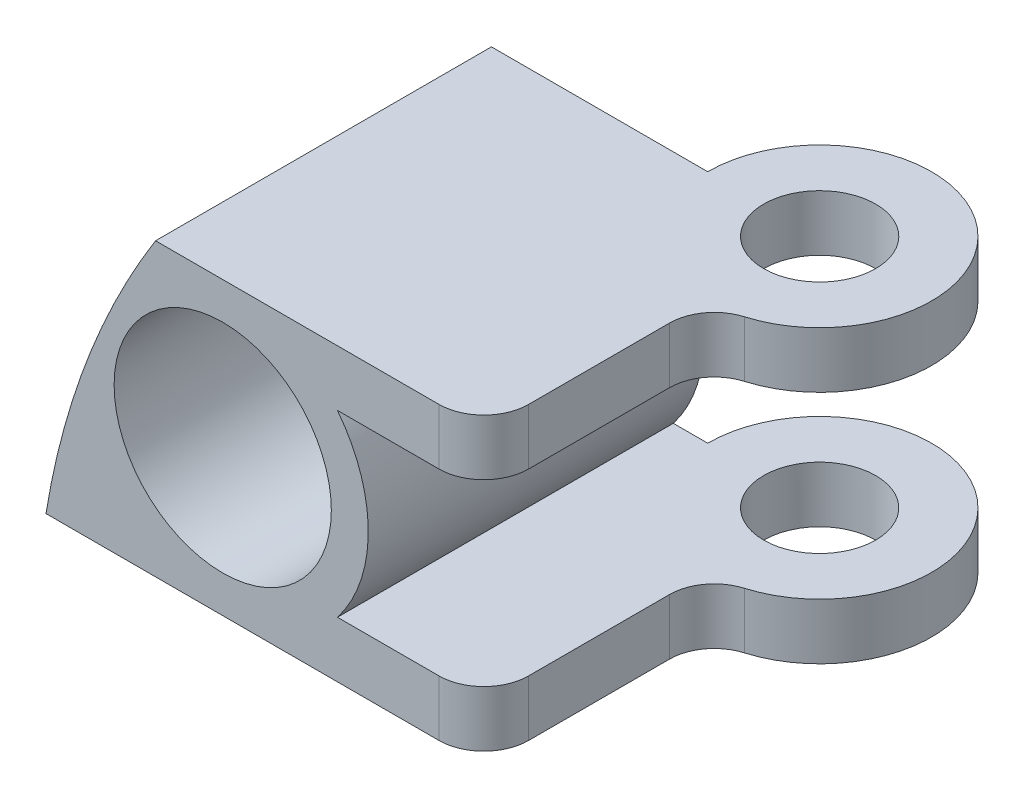
ISO-10303-21;
HEADER;
FILE_DESCRIPTION(('STEP AP214'),'2;1');
FILE_NAME('part.step','',(''),(''),'','','');
FILE_SCHEMA(('AUTOMOTIVE_DESIGN { 1 0 10303 214 1 1 1 1 }'));
ENDSEC;
DATA;
#1=APPLICATION_CONTEXT('core data for automotive mechanical design processes');
#2=APPLICATION_PROTOCOL_DEFINITION('international standard','automotive_design',2000,#1);
#3=PRODUCT_CONTEXT('',#1,'mechanical');
#4=PRODUCT('Part','Part','',(#3));
#5=PRODUCT_RELATED_PRODUCT_CATEGORY('part','',(#4));
#6=PRODUCT_DEFINITION_FORMATION('','',#4);
#7=PRODUCT_DEFINITION_CONTEXT('part definition',#1,'design');
#8=PRODUCT_DEFINITION('design','',#6,#7);
#9=PRODUCT_DEFINITION_SHAPE('','',#8);
#10=(LENGTH_UNIT() NAMED_UNIT(*) SI_UNIT(.MILLI.,.METRE.));
#11=(NAMED_UNIT(*) PLANE_ANGLE_UNIT() SI_UNIT($,.RADIAN.));
#12=(NAMED_UNIT(*) SI_UNIT($,.STERADIAN.) SOLID_ANGLE_UNIT());
#13=UNCERTAINTY_MEASURE_WITH_UNIT(LENGTH_MEASURE(1.E-05),#10,'distance_accuracy_value','');
#14=(GEOMETRIC_REPRESENTATION_CONTEXT(3) GLOBAL_UNCERTAINTY_ASSIGNED_CONTEXT((#13)) GLOBAL_UNIT_ASSIGNED_CONTEXT((#10,
#11,#12)) REPRESENTATION_CONTEXT('',''));
#15=CARTESIAN_POINT('',(0.,0.,0.));
#16=DIRECTION('',(0.,0.,1.));
#17=DIRECTION('',(1.,0.,0.));
#18=AXIS2_PLACEMENT_3D('',#15,#16,#17);
#19=CARTESIAN_POINT('',(-33.8574358250765,15.3458200795581,25.4));
#20=DIRECTION('',(0.,0.,1.));
#21=DIRECTION('',(1.,0.,0.));
#22=AXIS2_PLACEMENT_3D('',#19,#20,#21);
#23=PLANE('',#22);
#24=DIRECTION('',(1.,0.,0.));
#25=VECTOR('',#24,1.);
#26=CARTESIAN_POINT('',(-43.8807790564313,7.09082007955806,25.4));
#27=LINE('',#26,#25);
#28=CARTESIAN_POINT('',(-43.8807790564313,7.09082007955806,25.4));
#29=VERTEX_POINT('',#28);
#30=CARTESIAN_POINT('',(-21.59,7.09082007955806,25.4));
#31=VERTEX_POINT('',#30);
#32=EDGE_CURVE('E276',#29,#31,#27,.T.);
#33=ORIENTED_EDGE('',*,*,#32,.T.);
#34=DIRECTION('',(0.,1.,0.));
#35=VECTOR('',#34,1.);
#36=CARTESIAN_POINT('',(-21.59,10.2658200795581,25.4));
#37=LINE('',#36,#35);
#38=CARTESIAN_POINT('',(-21.59,10.2658200795581,25.4));
#39=VERTEX_POINT('',#38);
#40=EDGE_CURVE('E312',#31,#39,#37,.T.);
#41=ORIENTED_EDGE('',*,*,#40,.T.);
#42=DIRECTION('',(-1.,0.,0.));
#43=VECTOR('',#42,1.);
#44=CARTESIAN_POINT('',(-27.3506220886921,10.2658200795581,25.4));
#45=LINE('',#44,#43);
#46=CARTESIAN_POINT('',(-27.3506220886921,10.2658200795581,25.4));
#47=VERTEX_POINT('',#46);
#48=EDGE_CURVE('E273',#39,#47,#45,.T.);
#49=ORIENTED_EDGE('',*,*,#48,.T.);
#50=CARTESIAN_POINT('',(-33.8574358250765,15.3458200795581,25.4));
#51=DIRECTION('',(0.,0.,1.));
#52=DIRECTION('',(1.,0.,0.));
#53=AXIS2_PLACEMENT_3D('',#50,#51,#52);
#54=CIRCLE('',#53,8.255);
#55=CARTESIAN_POINT('',(-27.3506220886921,20.4258200795581,25.4));
#56=VERTEX_POINT('',#55);
#57=EDGE_CURVE('E270',#47,#56,#54,.T.);
#58=ORIENTED_EDGE('',*,*,#57,.T.);
#59=DIRECTION('',(1.,0.,0.));
#60=VECTOR('',#59,1.);
#61=CARTESIAN_POINT('',(-27.3506220886921,20.4258200795581,25.4));
#62=LINE('',#61,#60);
#63=CARTESIAN_POINT('',(-21.59,20.4258200795581,25.4));
#64=VERTEX_POINT('',#63);
#65=EDGE_CURVE('E328',#56,#64,#62,.T.);
#66=ORIENTED_EDGE('',*,*,#65,.T.);
#67=DIRECTION('',(0.,1.,0.));
#68=VECTOR('',#67,1.);
#69=CARTESIAN_POINT('',(-21.59,23.6008200795581,25.4));
#70=LINE('',#69,#68);
#71=CARTESIAN_POINT('',(-21.59,23.6008200795581,25.4));
#72=VERTEX_POINT('',#71);
#73=EDGE_CURVE('E309',#64,#72,#70,.T.);
#74=ORIENTED_EDGE('',*,*,#73,.T.);
#75=DIRECTION('',(-1.,0.,0.));
#76=VECTOR('',#75,1.);
#77=CARTESIAN_POINT('',(-37.6670119809407,23.6008200795581,25.4));
#78=LINE('',#77,#76);
#79=CARTESIAN_POINT('',(-37.6670119809407,23.6008200795581,25.4));
#80=VERTEX_POINT('',#79);
#81=EDGE_CURVE('E325',#72,#80,#78,.T.);
#82=ORIENTED_EDGE('',*,*,#81,.T.);
#83=CARTESIAN_POINT('',(0.,0.,25.4));
#84=DIRECTION('',(0.,0.,1.));
#85=DIRECTION('',(-1.,0.,0.));
#86=AXIS2_PLACEMENT_3D('',#83,#84,#85);
#87=CIRCLE('',#86,44.45);
#88=EDGE_CURVE('E332',#80,#29,#87,.T.);
#89=ORIENTED_EDGE('',*,*,#88,.T.);
#90=EDGE_LOOP('',(#33,#41,#49,#58,#66,#74,#82,#89));
#91=FACE_BOUND('',#90,.T.);
#92=CARTESIAN_POINT('',(-33.8574358250765,15.3458200795581,25.4));
#93=DIRECTION('',(0.,0.,1.));
#94=DIRECTION('',(1.,0.,0.));
#95=AXIS2_PLACEMENT_3D('',#92,#93,#94);
#96=CIRCLE('',#95,6.1595);
#97=CARTESIAN_POINT('',(-27.6979358250765,15.3458200795581,25.4));
#98=VERTEX_POINT('',#97);
#99=EDGE_CURVE('E334',#98,#98,#96,.T.);
#100=ORIENTED_EDGE('',*,*,#99,.F.);
#101=EDGE_LOOP('',(#100));
#102=FACE_BOUND('',#101,.T.);
#103=ADVANCED_FACE('F35',(#91,#102),#23,.T.);
#104=CARTESIAN_POINT('',(-33.8574358250765,15.3458200795581,25.4));
#105=DIRECTION('',(0.,0.,-1.));
#106=DIRECTION('',(-1.,0.,0.));
#107=AXIS2_PLACEMENT_3D('',#104,#105,#106);
#108=CYLINDRICAL_SURFACE('',#107,8.255);
#109=DIRECTION('',(0.,0.,-1.));
#110=VECTOR('',#109,1.);
#111=CARTESIAN_POINT('',(-27.3506220886921,10.2658200795581,25.4));
#112=LINE('',#111,#110);
#113=CARTESIAN_POINT('',(-27.3506220886921,10.2658200795581,6.35));
#114=VERTEX_POINT('',#113);
#115=EDGE_CURVE('E268',#47,#114,#112,.T.);
#116=ORIENTED_EDGE('',*,*,#115,.T.);
#117=CARTESIAN_POINT('',(-33.8574358250765,15.3458200795581,6.35));
#118=DIRECTION('',(0.,0.,1.));
#119=DIRECTION('',(1.,0.,0.));
#120=AXIS2_PLACEMENT_3D('',#117,#118,#119);
#121=CIRCLE('',#120,8.255);
#122=CARTESIAN_POINT('',(-27.3506220886921,20.4258200795581,6.35));
#123=VERTEX_POINT('',#122);
#124=EDGE_CURVE('E181',#114,#123,#121,.T.);
#125=ORIENTED_EDGE('',*,*,#124,.T.);
#126=DIRECTION('',(0.,0.,-1.));
#127=VECTOR('',#126,1.);
#128=CARTESIAN_POINT('',(-27.3506220886921,20.4258200795581,25.4));
#129=LINE('',#128,#127);
#130=EDGE_CURVE('E262',#56,#123,#129,.T.);
#131=ORIENTED_EDGE('',*,*,#130,.F.);
#132=ORIENTED_EDGE('',*,*,#57,.F.);
#133=EDGE_LOOP('',(#116,#125,#131,#132));
#134=FACE_BOUND('',#133,.T.);
#135=ADVANCED_FACE('F227',(#134),#108,.T.);
#136=CARTESIAN_POINT('',(-27.3506220886921,20.4258200795581,25.4));
#137=DIRECTION('',(0.,1.,0.));
#138=DIRECTION('',(0.,0.,1.));
#139=AXIS2_PLACEMENT_3D('',#136,#137,#138);
#140=PLANE('',#139);
#141=DIRECTION('',(0.,0.,1.));
#142=VECTOR('',#141,1.);
#143=CARTESIAN_POINT('',(-19.05,20.4258200795581,25.4));
#144=LINE('',#143,#142);
#145=CARTESIAN_POINT('',(-19.05,20.4258200795581,14.8694189942742));
#146=VERTEX_POINT('',#145);
#147=CARTESIAN_POINT('',(-19.05,20.4258200795581,22.86));
#148=VERTEX_POINT('',#147);
#149=EDGE_CURVE('E192',#146,#148,#144,.T.);
#150=ORIENTED_EDGE('',*,*,#149,.T.);
#151=CARTESIAN_POINT('',(-21.59,20.4258200795581,22.86));
#152=DIRECTION('',(0.,1.,0.));
#153=DIRECTION('',(0.,0.,1.));
#154=AXIS2_PLACEMENT_3D('',#151,#152,#153);
#155=CIRCLE('',#154,2.54);
#156=EDGE_CURVE('E11',#148,#64,#155,.F.);
#157=ORIENTED_EDGE('',*,*,#156,.T.);
#158=ORIENTED_EDGE('',*,*,#65,.F.);
#159=ORIENTED_EDGE('',*,*,#130,.T.);
#160=DIRECTION('',(1.,0.,0.));
#161=VECTOR('',#160,1.);
#162=CARTESIAN_POINT('',(-27.3506220886921,20.4258200795581,6.35));
#163=LINE('',#162,#161);
#164=CARTESIAN_POINT('',(-25.4,20.4258200795581,6.35));
#165=VERTEX_POINT('',#164);
#166=EDGE_CURVE('E184',#123,#165,#163,.T.);
#167=ORIENTED_EDGE('',*,*,#166,.T.);
#168=CARTESIAN_POINT('',(-19.05,20.4258200795581,6.35));
#169=DIRECTION('',(0.,1.,0.));
#170=DIRECTION('',(0.,0.,1.));
#171=AXIS2_PLACEMENT_3D('',#168,#169,#170);
#172=CIRCLE('',#171,6.35);
#173=CARTESIAN_POINT('',(-17.2357142857143,20.4258200795581,12.4352992816244));
#174=VERTEX_POINT('',#173);
#175=EDGE_CURVE('E189',#165,#174,#172,.F.);
#176=ORIENTED_EDGE('',*,*,#175,.T.);
#177=CARTESIAN_POINT('',(-16.51,20.4258200795581,14.8694189942742));
#178=DIRECTION('',(0.,1.,0.));
#179=DIRECTION('',(0.,0.,1.));
#180=AXIS2_PLACEMENT_3D('',#177,#178,#179);
#181=CIRCLE('',#180,2.54);
#182=EDGE_CURVE('E301',#174,#146,#181,.T.);
#183=ORIENTED_EDGE('',*,*,#182,.T.);
#184=EDGE_LOOP('',(#150,#157,#158,#159,#167,#176,#183));
#185=FACE_BOUND('',#184,.T.);
#186=CARTESIAN_POINT('',(-19.05,20.4258200795581,6.35));
#187=DIRECTION('',(0.,1.,0.));
#188=DIRECTION('',(0.,0.,1.));
#189=AXIS2_PLACEMENT_3D('',#186,#187,#188);
#190=CIRCLE('',#189,3.175);
#191=CARTESIAN_POINT('',(-19.05,20.4258200795581,9.525));
#192=VERTEX_POINT('',#191);
#193=EDGE_CURVE('E352',#192,#192,#190,.T.);
#194=ORIENTED_EDGE('',*,*,#193,.T.);
#195=EDGE_LOOP('',(#194));
#196=FACE_BOUND('',#195,.T.);
#197=ADVANCED_FACE('F240',(#185,#196),#140,.F.);
#198=CARTESIAN_POINT('',(-37.6670119809407,23.6008200795581,25.4));
#199=DIRECTION('',(0.,-1.,0.));
#200=DIRECTION('',(0.,0.,-1.));
#201=AXIS2_PLACEMENT_3D('',#198,#199,#200);
#202=PLANE('',#201);
#203=ORIENTED_EDGE('',*,*,#81,.F.);
#204=CARTESIAN_POINT('',(-21.59,23.6008200795581,22.86));
#205=DIRECTION('',(0.,-1.,0.));
#206=DIRECTION('',(0.,0.,-1.));
#207=AXIS2_PLACEMENT_3D('',#204,#205,#206);
#208=CIRCLE('',#207,2.54);
#209=CARTESIAN_POINT('',(-19.05,23.6008200795581,22.86));
#210=VERTEX_POINT('',#209);
#211=EDGE_CURVE('E322',#72,#210,#208,.F.);
#212=ORIENTED_EDGE('',*,*,#211,.T.);
#213=DIRECTION('',(0.,0.,1.));
#214=VECTOR('',#213,1.);
#215=CARTESIAN_POINT('',(-19.05,23.6008200795581,12.7));
#216=LINE('',#215,#214);
#217=CARTESIAN_POINT('',(-19.05,23.6008200795581,14.8694189942742));
#218=VERTEX_POINT('',#217);
#219=EDGE_CURVE('E166',#218,#210,#216,.T.);
#220=ORIENTED_EDGE('',*,*,#219,.F.);
#221=CARTESIAN_POINT('',(-16.51,23.6008200795581,14.8694189942742));
#222=DIRECTION('',(0.,-1.,0.));
#223=DIRECTION('',(0.,0.,-1.));
#224=AXIS2_PLACEMENT_3D('',#221,#222,#223);
#225=CIRCLE('',#224,2.54);
#226=CARTESIAN_POINT('',(-17.2357142857143,23.6008200795581,12.4352992816244));
#227=VERTEX_POINT('',#226);
#228=EDGE_CURVE('E253',#218,#227,#225,.T.);
#229=ORIENTED_EDGE('',*,*,#228,.T.);
#230=CARTESIAN_POINT('',(-19.05,23.6008200795581,6.35));
#231=DIRECTION('',(0.,-1.,0.));
#232=DIRECTION('',(0.,0.,1.));
#233=AXIS2_PLACEMENT_3D('',#230,#231,#232);
#234=CIRCLE('',#233,6.35);
#235=CARTESIAN_POINT('',(-25.4,23.6008200795581,6.35));
#236=VERTEX_POINT('',#235);
#237=EDGE_CURVE('E168',#236,#227,#234,.T.);
#238=ORIENTED_EDGE('',*,*,#237,.F.);
#239=DIRECTION('',(1.,0.,0.));
#240=VECTOR('',#239,1.);
#241=CARTESIAN_POINT('',(-40.64,23.6008200795581,6.35));
#242=LINE('',#241,#240);
#243=CARTESIAN_POINT('',(-37.6670119809407,23.6008200795581,6.35));
#244=VERTEX_POINT('',#243);
#245=EDGE_CURVE('E173',#244,#236,#242,.T.);
#246=ORIENTED_EDGE('',*,*,#245,.F.);
#247=DIRECTION('',(0.,0.,-1.));
#248=VECTOR('',#247,1.);
#249=CARTESIAN_POINT('',(-37.6670119809407,23.6008200795581,25.4));
#250=LINE('',#249,#248);
#251=EDGE_CURVE('E244',#80,#244,#250,.T.);
#252=ORIENTED_EDGE('',*,*,#251,.F.);
#253=EDGE_LOOP('',(#203,#212,#220,#229,#238,#246,#252));
#254=FACE_BOUND('',#253,.T.);
#255=CARTESIAN_POINT('',(-19.05,23.6008200795581,6.35));
#256=DIRECTION('',(0.,1.,0.));
#257=DIRECTION('',(0.,0.,1.));
#258=AXIS2_PLACEMENT_3D('',#255,#256,#257);
#259=CIRCLE('',#258,3.175);
#260=CARTESIAN_POINT('',(-19.05,23.6008200795581,9.525));
#261=VERTEX_POINT('',#260);
#262=EDGE_CURVE('E202',#261,#261,#259,.T.);
#263=ORIENTED_EDGE('',*,*,#262,.F.);
#264=EDGE_LOOP('',(#263));
#265=FACE_BOUND('',#264,.T.);
#266=ADVANCED_FACE('F235',(#254,#265),#202,.F.);
#267=CARTESIAN_POINT('',(0.,0.,25.4));
#268=DIRECTION('',(0.,0.,-1.));
#269=DIRECTION('',(-1.,0.,0.));
#270=AXIS2_PLACEMENT_3D('',#267,#268,#269);
#271=CYLINDRICAL_SURFACE('',#270,44.45);
#272=CARTESIAN_POINT('',(0.,0.,6.35));
#273=DIRECTION('',(0.,0.,1.));
#274=DIRECTION('',(1.,0.,0.));
#275=AXIS2_PLACEMENT_3D('',#272,#273,#274);
#276=CIRCLE('',#275,44.45);
#277=CARTESIAN_POINT('',(-40.64,18.0053575360224,6.35));
#278=VERTEX_POINT('',#277);
#279=EDGE_CURVE('E187',#244,#278,#276,.T.);
#280=ORIENTED_EDGE('',*,*,#279,.T.);
#281=CARTESIAN_POINT('',(-40.64,18.0053575360224,6.35));
#282=CARTESIAN_POINT('',(-40.6399858684762,18.0053850674031,6.42860205927988));
#283=CARTESIAN_POINT('',(-40.6414589667043,18.0020644090249,6.50718713842052));
#284=CARTESIAN_POINT('',(-40.6472714524176,17.9889387291809,6.6636382192536));
#285=CARTESIAN_POINT('',(-40.6516082538039,17.979139558198,6.74150480551763));
#286=CARTESIAN_POINT('',(-40.6629877454723,17.953387179122,6.89526719531025));
#287=CARTESIAN_POINT('',(-40.670005174567,17.9374914174421,6.97117453940111));
#288=CARTESIAN_POINT('',(-40.6865585221489,17.8999128340143,7.12125351985808));
#289=CARTESIAN_POINT('',(-40.6960948907276,17.8782289780255,7.19542484344604));
#290=CARTESIAN_POINT('',(-40.7280809302924,17.8053006165963,7.41418329624837));
#291=CARTESIAN_POINT('',(-40.7539593059729,17.7460632897751,7.55567326486585));
#292=CARTESIAN_POINT('',(-40.8129268155589,17.6100265474026,7.82846613663836));
#293=CARTESIAN_POINT('',(-40.8460337895425,17.5331836580071,7.95974272639628));
#294=CARTESIAN_POINT('',(-40.9432545484435,17.3053912774347,8.30191851672014));
#295=CARTESIAN_POINT('',(-41.0125677515992,17.1408389041428,8.50233665325664));
#296=CARTESIAN_POINT('',(-41.1227473901252,16.8739931244987,8.78060266897358));
#297=CARTESIAN_POINT('',(-41.160581652018,16.7815262143035,8.86976949615618));
#298=CARTESIAN_POINT('',(-41.2377412537271,16.5910131308004,9.0412530228011));
#299=CARTESIAN_POINT('',(-41.2770662713191,16.492968160912,9.1235711904387));
#300=CARTESIAN_POINT('',(-41.3892881018672,16.2101141877237,9.34676355510312));
#301=CARTESIAN_POINT('',(-41.4632986423793,16.0200194827513,9.48036971614077));
#302=CARTESIAN_POINT('',(-41.612304225724,15.6289016411106,9.72993927328907));
#303=CARTESIAN_POINT('',(-41.687300072299,15.4278691004059,9.84588715128312));
#304=CARTESIAN_POINT('',(-41.8369591075026,15.0172968330521,10.0629604635134));
#305=CARTESIAN_POINT('',(-41.9116212420885,14.8077398368429,10.1640536771114));
#306=CARTESIAN_POINT('',(-42.0594463948925,14.3824948297918,10.3533162747553));
#307=CARTESIAN_POINT('',(-42.1326098434426,14.1668086225886,10.4414894147122));
#308=CARTESIAN_POINT('',(-42.2840664126217,13.7085444117589,10.6151224590177));
#309=CARTESIAN_POINT('',(-42.3621317889708,13.4654496892092,10.6994099343058));
#310=CARTESIAN_POINT('',(-42.5150453128146,12.9745731407807,10.8565832502906));
#311=CARTESIAN_POINT('',(-42.5898926791861,12.7267901976925,10.9294663339493));
#312=CARTESIAN_POINT('',(-42.7359817981814,12.2272704887145,11.0654845232775));
#313=CARTESIAN_POINT('',(-42.8072201931958,11.9755303164475,11.1286106595937));
#314=CARTESIAN_POINT('',(-42.9457122756752,11.4689695287864,11.2463756369765));
#315=CARTESIAN_POINT('',(-43.012965494977,11.2141485556887,11.3010134820888));
#316=CARTESIAN_POINT('',(-43.1432601708625,10.7019363824853,11.4029135052793));
#317=CARTESIAN_POINT('',(-43.2063010465743,10.4445448335055,11.4501746673263));
#318=CARTESIAN_POINT('',(-43.3279970552494,9.92762373124177,11.5382422780082));
#319=CARTESIAN_POINT('',(-43.3866518278721,9.66809400423591,11.5790481966186));
#320=CARTESIAN_POINT('',(-43.5557643325157,8.88714520807768,11.6929499554332));
#321=CARTESIAN_POINT('',(-43.6594672686087,8.3629857111762,11.7576028532993));
#322=CARTESIAN_POINT('',(-43.7760131513114,7.71226899882168,11.8266259838594));
#323=CARTESIAN_POINT('',(-43.7977140320062,7.5880611330193,11.8392985217988));
#324=CARTESIAN_POINT('',(-43.8400424608099,7.33955210516721,11.8636986749844));
#325=CARTESIAN_POINT('',(-43.8606714812607,7.21525132251778,11.8754275992517));
#326=CARTESIAN_POINT('',(-43.8807790564313,7.09082007955806,11.8867179017965));
#327=B_SPLINE_CURVE_WITH_KNOTS('',3,(#281,#282,#283,#284,#285,#286,#287,#288,#289,#290,#291,
#292,#293,#294,#295,#296,#297,#298,#299,#300,#301,#302,#303,#304,#305,#306,#307,#308,#309,#310,
#311,#312,#313,#314,#315,#316,#317,#318,#319,#320,#321,#322,#323,#324,#325,#326),.UNSPECIFIED.,
.F.,.F.,(4,2,2,2,2,2,2,2,2,2,2,2,2,2,2,2,2,2,2,2,2,2,4),(0.,0.235694740019568,0.471176923855376,
0.704492676434341,0.937850146784164,1.4025774760099,1.86846497782513,2.66874785915352,
3.07031815307747,3.47180213771034,4.20215206583604,4.93314016787749,5.66569113444536,
6.39802872157083,7.20429450491854,8.01075490473667,8.81795231266198,9.62524435983153,
10.4326475018449,11.2401169034104,12.8538582290616,13.2340305774573,13.6136660991286),.UNSPECIFIED.);
#328=CARTESIAN_POINT('',(-43.8807790564313,7.09082007955806,11.8867179017965));
#329=VERTEX_POINT('',#328);
#330=EDGE_CURVE('E144',#278,#329,#327,.T.);
#331=ORIENTED_EDGE('',*,*,#330,.T.);
#332=DIRECTION('',(0.,0.,-1.));
#333=VECTOR('',#332,1.);
#334=CARTESIAN_POINT('',(-43.8807790564313,7.09082007955806,25.4));
#335=LINE('',#334,#333);
#336=EDGE_CURVE('E165',#29,#329,#335,.T.);
#337=ORIENTED_EDGE('',*,*,#336,.F.);
#338=ORIENTED_EDGE('',*,*,#88,.F.);
#339=ORIENTED_EDGE('',*,*,#251,.T.);
#340=EDGE_LOOP('',(#280,#331,#337,#338,#339));
#341=FACE_BOUND('',#340,.T.);
#342=ADVANCED_FACE('F204',(#341),#271,.T.);
#343=CARTESIAN_POINT('',(-43.8807790564313,7.09082007955806,25.4));
#344=DIRECTION('',(0.,1.,0.));
#345=DIRECTION('',(0.,0.,1.));
#346=AXIS2_PLACEMENT_3D('',#343,#344,#345);
#347=PLANE('',#346);
#348=DIRECTION('',(0.,0.,1.));
#349=VECTOR('',#348,1.);
#350=CARTESIAN_POINT('',(-19.05,7.09082007955806,12.7));
#351=LINE('',#350,#349);
#352=CARTESIAN_POINT('',(-19.05,7.09082007955806,14.8694189942742));
#353=VERTEX_POINT('',#352);
#354=CARTESIAN_POINT('',(-19.05,7.09082007955806,22.86));
#355=VERTEX_POINT('',#354);
#356=EDGE_CURVE('E148',#353,#355,#351,.T.);
#357=ORIENTED_EDGE('',*,*,#356,.T.);
#358=CARTESIAN_POINT('',(-21.59,7.09082007955806,22.86));
#359=DIRECTION('',(0.,1.,0.));
#360=DIRECTION('',(0.,0.,1.));
#361=AXIS2_PLACEMENT_3D('',#358,#359,#360);
#362=CIRCLE('',#361,2.54);
#363=EDGE_CURVE('E320',#355,#31,#362,.F.);
#364=ORIENTED_EDGE('',*,*,#363,.T.);
#365=ORIENTED_EDGE('',*,*,#32,.F.);
#366=ORIENTED_EDGE('',*,*,#336,.T.);
#367=CARTESIAN_POINT('',(-46.99,7.09082007955806,6.35));
#368=DIRECTION('',(0.,1.,0.));
#369=DIRECTION('',(0.,0.,1.));
#370=AXIS2_PLACEMENT_3D('',#367,#368,#369);
#371=CIRCLE('',#370,6.35);
#372=CARTESIAN_POINT('',(-40.64,7.09082007955806,6.35));
#373=VERTEX_POINT('',#372);
#374=EDGE_CURVE('E141',#329,#373,#371,.T.);
#375=ORIENTED_EDGE('',*,*,#374,.T.);
#376=DIRECTION('',(1.,0.,0.));
#377=VECTOR('',#376,1.);
#378=CARTESIAN_POINT('',(-40.64,7.09082007955806,6.35));
#379=LINE('',#378,#377);
#380=CARTESIAN_POINT('',(-25.4,7.09082007955806,6.35));
#381=VERTEX_POINT('',#380);
#382=EDGE_CURVE('E151',#373,#381,#379,.T.);
#383=ORIENTED_EDGE('',*,*,#382,.T.);
#384=CARTESIAN_POINT('',(-19.05,7.09082007955806,6.35));
#385=DIRECTION('',(0.,-1.,0.));
#386=DIRECTION('',(0.,0.,1.));
#387=AXIS2_PLACEMENT_3D('',#384,#385,#386);
#388=CIRCLE('',#387,6.35);
#389=CARTESIAN_POINT('',(-17.2357142857143,7.09082007955806,12.4352992816244));
#390=VERTEX_POINT('',#389);
#391=EDGE_CURVE('E159',#381,#390,#388,.T.);
#392=ORIENTED_EDGE('',*,*,#391,.T.);
#393=CARTESIAN_POINT('',(-16.51,7.09082007955806,14.8694189942742));
#394=DIRECTION('',(0.,1.,0.));
#395=DIRECTION('',(0.,0.,1.));
#396=AXIS2_PLACEMENT_3D('',#393,#394,#395);
#397=CIRCLE('',#396,2.54);
#398=EDGE_CURVE('E306',#390,#353,#397,.T.);
#399=ORIENTED_EDGE('',*,*,#398,.T.);
#400=EDGE_LOOP('',(#357,#364,#365,#366,#375,#383,#392,#399));
#401=FACE_BOUND('',#400,.T.);
#402=CARTESIAN_POINT('',(-19.05,7.09082007955806,6.35));
#403=DIRECTION('',(0.,1.,0.));
#404=DIRECTION('',(0.,0.,1.));
#405=AXIS2_PLACEMENT_3D('',#402,#403,#404);
#406=CIRCLE('',#405,3.175);
#407=CARTESIAN_POINT('',(-19.05,7.09082007955806,9.525));
#408=VERTEX_POINT('',#407);
#409=EDGE_CURVE('E286',#408,#408,#406,.T.);
#410=ORIENTED_EDGE('',*,*,#409,.T.);
#411=EDGE_LOOP('',(#410));
#412=FACE_BOUND('',#411,.T.);
#413=ADVANCED_FACE('F162',(#401,#412),#347,.F.);
#414=CARTESIAN_POINT('',(-27.3506220886921,10.2658200795581,25.4));
#415=DIRECTION('',(0.,-1.,0.));
#416=DIRECTION('',(0.,0.,-1.));
#417=AXIS2_PLACEMENT_3D('',#414,#415,#416);
#418=PLANE('',#417);
#419=ORIENTED_EDGE('',*,*,#48,.F.);
#420=CARTESIAN_POINT('',(-21.59,10.2658200795581,22.86));
#421=DIRECTION('',(0.,-1.,0.));
#422=DIRECTION('',(0.,0.,-1.));
#423=AXIS2_PLACEMENT_3D('',#420,#421,#422);
#424=CIRCLE('',#423,2.54);
#425=CARTESIAN_POINT('',(-19.05,10.2658200795581,22.86));
#426=VERTEX_POINT('',#425);
#427=EDGE_CURVE('E315',#39,#426,#424,.F.);
#428=ORIENTED_EDGE('',*,*,#427,.T.);
#429=DIRECTION('',(0.,0.,-1.));
#430=VECTOR('',#429,1.);
#431=CARTESIAN_POINT('',(-19.05,10.2658200795581,25.4));
#432=LINE('',#431,#430);
#433=CARTESIAN_POINT('',(-19.05,10.2658200795581,14.8694189942742));
#434=VERTEX_POINT('',#433);
#435=EDGE_CURVE('E290',#426,#434,#432,.T.);
#436=ORIENTED_EDGE('',*,*,#435,.T.);
#437=CARTESIAN_POINT('',(-16.51,10.2658200795581,14.8694189942742));
#438=DIRECTION('',(0.,-1.,0.));
#439=DIRECTION('',(0.,0.,-1.));
#440=AXIS2_PLACEMENT_3D('',#437,#438,#439);
#441=CIRCLE('',#440,2.54);
#442=CARTESIAN_POINT('',(-17.2357142857143,10.2658200795581,12.4352992816244));
#443=VERTEX_POINT('',#442);
#444=EDGE_CURVE('E303',#434,#443,#441,.T.);
#445=ORIENTED_EDGE('',*,*,#444,.T.);
#446=CARTESIAN_POINT('',(-19.05,10.2658200795581,6.35));
#447=DIRECTION('',(0.,-1.,0.));
#448=DIRECTION('',(0.,0.,-1.));
#449=AXIS2_PLACEMENT_3D('',#446,#447,#448);
#450=CIRCLE('',#449,6.35);
#451=CARTESIAN_POINT('',(-25.4,10.2658200795581,6.35));
#452=VERTEX_POINT('',#451);
#453=EDGE_CURVE('E282',#443,#452,#450,.F.);
#454=ORIENTED_EDGE('',*,*,#453,.T.);
#455=DIRECTION('',(-1.,0.,0.));
#456=VECTOR('',#455,1.);
#457=CARTESIAN_POINT('',(-27.3506220886921,10.2658200795581,6.35));
#458=LINE('',#457,#456);
#459=EDGE_CURVE('E179',#452,#114,#458,.T.);
#460=ORIENTED_EDGE('',*,*,#459,.T.);
#461=ORIENTED_EDGE('',*,*,#115,.F.);
#462=EDGE_LOOP('',(#419,#428,#436,#445,#454,#460,#461));
#463=FACE_BOUND('',#462,.T.);
#464=CARTESIAN_POINT('',(-19.05,10.2658200795581,6.35));
#465=DIRECTION('',(0.,-1.,0.));
#466=DIRECTION('',(0.,0.,-1.));
#467=AXIS2_PLACEMENT_3D('',#464,#465,#466);
#468=CIRCLE('',#467,3.175);
#469=CARTESIAN_POINT('',(-19.05,10.2658200795581,3.175));
#470=VERTEX_POINT('',#469);
#471=EDGE_CURVE('E283',#470,#470,#468,.T.);
#472=ORIENTED_EDGE('',*,*,#471,.T.);
#473=EDGE_LOOP('',(#472));
#474=FACE_BOUND('',#473,.T.);
#475=ADVANCED_FACE('F223',(#463,#474),#418,.F.);
#476=CARTESIAN_POINT('',(-33.8574358250765,15.3458200795581,25.4));
#477=DIRECTION('',(0.,0.,-1.));
#478=DIRECTION('',(-1.,0.,0.));
#479=AXIS2_PLACEMENT_3D('',#476,#477,#478);
#480=CYLINDRICAL_SURFACE('',#479,6.1595);
#481=CARTESIAN_POINT('',(-33.8574358250765,15.3458200795581,6.35));
#482=DIRECTION('',(0.,0.,1.));
#483=DIRECTION('',(1.,0.,0.));
#484=AXIS2_PLACEMENT_3D('',#481,#482,#483);
#485=CIRCLE('',#484,6.1595);
#486=CARTESIAN_POINT('',(-27.6979358250765,15.3458200795581,6.35));
#487=VERTEX_POINT('',#486);
#488=EDGE_CURVE('E177',#487,#487,#485,.T.);
#489=ORIENTED_EDGE('',*,*,#488,.F.);
#490=EDGE_LOOP('',(#489));
#491=FACE_BOUND('',#490,.T.);
#492=ORIENTED_EDGE('',*,*,#99,.T.);
#493=EDGE_LOOP('',(#492));
#494=FACE_BOUND('',#493,.T.);
#495=ADVANCED_FACE('F220',(#491,#494),#480,.F.);
#496=CARTESIAN_POINT('',(-19.05,-1.79917992044194,6.35));
#497=DIRECTION('',(0.,1.,0.));
#498=DIRECTION('',(0.,0.,1.));
#499=AXIS2_PLACEMENT_3D('',#496,#497,#498);
#500=CYLINDRICAL_SURFACE('',#499,3.175);
#501=ORIENTED_EDGE('',*,*,#471,.F.);
#502=EDGE_LOOP('',(#501));
#503=FACE_BOUND('',#502,.T.);
#504=ORIENTED_EDGE('',*,*,#409,.F.);
#505=EDGE_LOOP('',(#504));
#506=FACE_BOUND('',#505,.T.);
#507=ADVANCED_FACE('F218',(#503,#506),#500,.F.);
#508=ORIENTED_EDGE('',*,*,#262,.T.);
#509=EDGE_LOOP('',(#508));
#510=FACE_BOUND('',#509,.T.);
#511=ORIENTED_EDGE('',*,*,#193,.F.);
#512=EDGE_LOOP('',(#511));
#513=FACE_BOUND('',#512,.T.);
#514=ADVANCED_FACE('F215',(#510,#513),#500,.F.);
#515=CARTESIAN_POINT('',(-40.64,7.09082007955806,6.35));
#516=DIRECTION('',(0.,0.,1.));
#517=DIRECTION('',(1.,0.,0.));
#518=AXIS2_PLACEMENT_3D('',#515,#516,#517);
#519=PLANE('',#518);
#520=ORIENTED_EDGE('',*,*,#488,.T.);
#521=EDGE_LOOP('',(#520));
#522=FACE_BOUND('',#521,.T.);
#523=ORIENTED_EDGE('',*,*,#245,.T.);
#524=DIRECTION('',(0.,1.,0.));
#525=VECTOR('',#524,1.);
#526=CARTESIAN_POINT('',(-25.4,7.09082007955806,6.35));
#527=LINE('',#526,#525);
#528=EDGE_CURVE('E147',#165,#236,#527,.T.);
#529=ORIENTED_EDGE('',*,*,#528,.F.);
#530=ORIENTED_EDGE('',*,*,#166,.F.);
#531=ORIENTED_EDGE('',*,*,#124,.F.);
#532=ORIENTED_EDGE('',*,*,#459,.F.);
#533=EDGE_CURVE('E155',#381,#452,#527,.T.);
#534=ORIENTED_EDGE('',*,*,#533,.F.);
#535=ORIENTED_EDGE('',*,*,#382,.F.);
#536=DIRECTION('',(0.,1.,0.));
#537=VECTOR('',#536,1.);
#538=CARTESIAN_POINT('',(-40.64,7.09082007955806,6.35));
#539=LINE('',#538,#537);
#540=EDGE_CURVE('E137',#373,#278,#539,.T.);
#541=ORIENTED_EDGE('',*,*,#540,.T.);
#542=ORIENTED_EDGE('',*,*,#279,.F.);
#543=EDGE_LOOP('',(#523,#529,#530,#531,#532,#534,#535,#541,#542));
#544=FACE_BOUND('',#543,.T.);
#545=ADVANCED_FACE('F153',(#522,#544),#519,.F.);
#546=CARTESIAN_POINT('',(-19.05,7.09082007955806,6.35));
#547=DIRECTION('',(0.,1.,0.));
#548=DIRECTION('',(0.,0.,1.));
#549=AXIS2_PLACEMENT_3D('',#546,#547,#548);
#550=CYLINDRICAL_SURFACE('',#549,6.35);
#551=ORIENTED_EDGE('',*,*,#453,.F.);
#552=DIRECTION('',(0.,1.,0.));
#553=VECTOR('',#552,1.);
#554=CARTESIAN_POINT('',(-17.2357142857143,7.09082007955806,12.4352992816244));
#555=LINE('',#554,#553);
#556=EDGE_CURVE('E298',#443,#390,#555,.F.);
#557=ORIENTED_EDGE('',*,*,#556,.T.);
#558=ORIENTED_EDGE('',*,*,#391,.F.);
#559=ORIENTED_EDGE('',*,*,#533,.T.);
#560=EDGE_LOOP('',(#551,#557,#558,#559));
#561=FACE_BOUND('',#560,.T.);
#562=ADVANCED_FACE('F213',(#561),#550,.T.);
#563=CARTESIAN_POINT('',(-46.99,7.09082007955806,6.35));
#564=DIRECTION('',(0.,1.,0.));
#565=DIRECTION('',(0.,0.,1.));
#566=AXIS2_PLACEMENT_3D('',#563,#564,#565);
#567=CYLINDRICAL_SURFACE('',#566,6.35);
#568=ORIENTED_EDGE('',*,*,#540,.F.);
#569=ORIENTED_EDGE('',*,*,#374,.F.);
#570=ORIENTED_EDGE('',*,*,#330,.F.);
#571=EDGE_LOOP('',(#568,#569,#570));
#572=FACE_BOUND('',#571,.T.);
#573=ADVANCED_FACE('F139',(#572),#567,.F.);
#574=ORIENTED_EDGE('',*,*,#237,.T.);
#575=DIRECTION('',(0.,1.,0.));
#576=VECTOR('',#575,1.);
#577=CARTESIAN_POINT('',(-17.2357142857143,7.09082007955806,12.4352992816244));
#578=LINE('',#577,#576);
#579=EDGE_CURVE('E255',#227,#174,#578,.F.);
#580=ORIENTED_EDGE('',*,*,#579,.T.);
#581=ORIENTED_EDGE('',*,*,#175,.F.);
#582=ORIENTED_EDGE('',*,*,#528,.T.);
#583=EDGE_LOOP('',(#574,#580,#581,#582));
#584=FACE_BOUND('',#583,.T.);
#585=ADVANCED_FACE('F212',(#584),#550,.T.);
#586=CARTESIAN_POINT('',(-19.05,7.09082007955806,12.7));
#587=DIRECTION('',(-1.,0.,0.));
#588=DIRECTION('',(0.,0.,1.));
#589=AXIS2_PLACEMENT_3D('',#586,#587,#588);
#590=PLANE('',#589);
#591=ORIENTED_EDGE('',*,*,#435,.F.);
#592=DIRECTION('',(0.,1.,0.));
#593=VECTOR('',#592,1.);
#594=CARTESIAN_POINT('',(-19.05,7.09082007955806,22.86));
#595=LINE('',#594,#593);
#596=EDGE_CURVE('E318',#426,#355,#595,.F.);
#597=ORIENTED_EDGE('',*,*,#596,.T.);
#598=ORIENTED_EDGE('',*,*,#356,.F.);
#599=DIRECTION('',(0.,-1.,0.));
#600=VECTOR('',#599,1.);
#601=CARTESIAN_POINT('',(-19.05,10.2658200795581,14.8694189942742));
#602=LINE('',#601,#600);
#603=EDGE_CURVE('E296',#353,#434,#602,.F.);
#604=ORIENTED_EDGE('',*,*,#603,.T.);
#605=EDGE_LOOP('',(#591,#597,#598,#604));
#606=FACE_BOUND('',#605,.T.);
#607=ADVANCED_FACE('F407',(#606),#590,.F.);
#608=ORIENTED_EDGE('',*,*,#219,.T.);
#609=DIRECTION('',(0.,1.,0.));
#610=VECTOR('',#609,1.);
#611=CARTESIAN_POINT('',(-19.05,20.4258200795581,22.86));
#612=LINE('',#611,#610);
#613=EDGE_CURVE('E43',#210,#148,#612,.F.);
#614=ORIENTED_EDGE('',*,*,#613,.T.);
#615=ORIENTED_EDGE('',*,*,#149,.F.);
#616=DIRECTION('',(0.,-1.,0.));
#617=VECTOR('',#616,1.);
#618=CARTESIAN_POINT('',(-19.05,23.6008200795581,14.8694189942742));
#619=LINE('',#618,#617);
#620=EDGE_CURVE('E293',#146,#218,#619,.F.);
#621=ORIENTED_EDGE('',*,*,#620,.T.);
#622=EDGE_LOOP('',(#608,#614,#615,#621));
#623=FACE_BOUND('',#622,.T.);
#624=ADVANCED_FACE('F371',(#623),#590,.F.);
#625=CARTESIAN_POINT('',(-16.51,7.09082007955806,14.8694189942742));
#626=DIRECTION('',(0.,1.,0.));
#627=DIRECTION('',(0.,0.,1.));
#628=AXIS2_PLACEMENT_3D('',#625,#626,#627);
#629=CYLINDRICAL_SURFACE('',#628,2.54);
#630=ORIENTED_EDGE('',*,*,#182,.F.);
#631=ORIENTED_EDGE('',*,*,#579,.F.);
#632=ORIENTED_EDGE('',*,*,#228,.F.);
#633=ORIENTED_EDGE('',*,*,#620,.F.);
#634=EDGE_LOOP('',(#630,#631,#632,#633));
#635=FACE_BOUND('',#634,.T.);
#636=ADVANCED_FACE('F367',(#635),#629,.F.);
#637=CARTESIAN_POINT('',(-16.51,7.09082007955806,14.8694189942742));
#638=DIRECTION('',(0.,1.,0.));
#639=DIRECTION('',(0.,0.,1.));
#640=AXIS2_PLACEMENT_3D('',#637,#638,#639);
#641=CYLINDRICAL_SURFACE('',#640,2.54);
#642=ORIENTED_EDGE('',*,*,#398,.F.);
#643=ORIENTED_EDGE('',*,*,#556,.F.);
#644=ORIENTED_EDGE('',*,*,#444,.F.);
#645=ORIENTED_EDGE('',*,*,#603,.F.);
#646=EDGE_LOOP('',(#642,#643,#644,#645));
#647=FACE_BOUND('',#646,.T.);
#648=ADVANCED_FACE('F370',(#647),#641,.F.);
#649=CARTESIAN_POINT('',(-21.59,15.3458200795581,22.86));
#650=DIRECTION('',(0.,-1.,0.));
#651=DIRECTION('',(0.,0.,-1.));
#652=AXIS2_PLACEMENT_3D('',#649,#650,#651);
#653=CYLINDRICAL_SURFACE('',#652,2.54);
#654=ORIENTED_EDGE('',*,*,#363,.F.);
#655=ORIENTED_EDGE('',*,*,#596,.F.);
#656=ORIENTED_EDGE('',*,*,#427,.F.);
#657=ORIENTED_EDGE('',*,*,#40,.F.);
#658=EDGE_LOOP('',(#654,#655,#656,#657));
#659=FACE_BOUND('',#658,.T.);
#660=ADVANCED_FACE('F343',(#659),#653,.T.);
#661=CARTESIAN_POINT('',(-21.59,15.3458200795581,22.86));
#662=DIRECTION('',(0.,-1.,0.));
#663=DIRECTION('',(0.,0.,-1.));
#664=AXIS2_PLACEMENT_3D('',#661,#662,#663);
#665=CYLINDRICAL_SURFACE('',#664,2.54);
#666=ORIENTED_EDGE('',*,*,#156,.F.);
#667=ORIENTED_EDGE('',*,*,#613,.F.);
#668=ORIENTED_EDGE('',*,*,#211,.F.);
#669=ORIENTED_EDGE('',*,*,#73,.F.);
#670=EDGE_LOOP('',(#666,#667,#668,#669));
#671=FACE_BOUND('',#670,.T.);
#672=ADVANCED_FACE('F37',(#671),#665,.T.);
#673=CLOSED_SHELL('',(#103,#135,#197,#266,#342,#413,#475,#495,#507,#514,#545,#562,#573,#585,
#607,#624,#636,#648,#660,#672));
#674=MANIFOLD_SOLID_BREP('B2',#673);
#675=ADVANCED_BREP_SHAPE_REPRESENTATION('',(#18,#674),#14);
#676=SHAPE_DEFINITION_REPRESENTATION(#9,#675);
ENDSEC;
END-ISO-10303-21;
